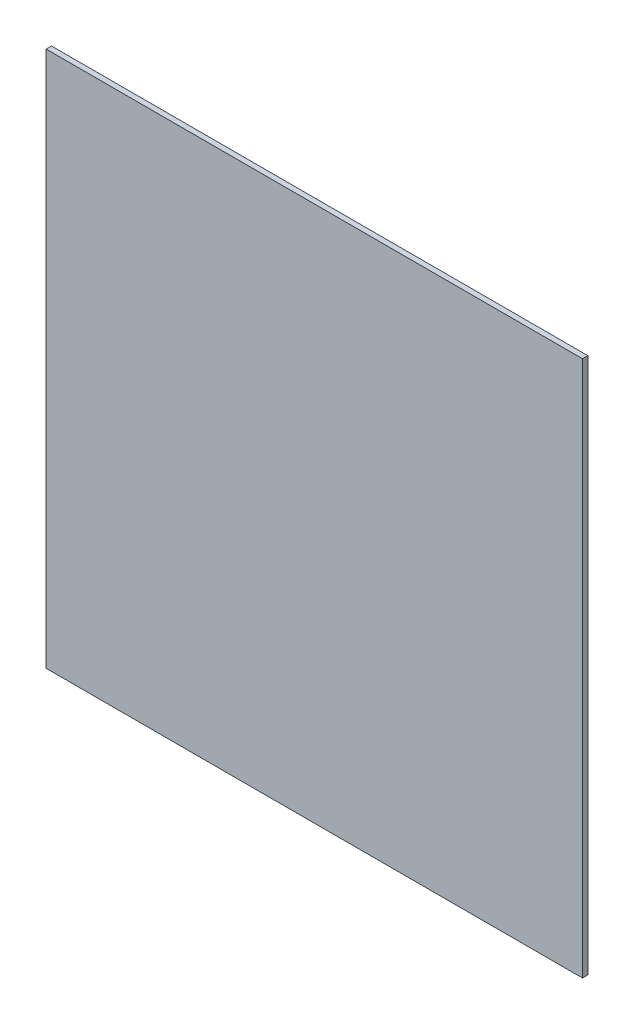
ISO-10303-21;
HEADER;
FILE_DESCRIPTION(('STEP AP214'),'2;1');
FILE_NAME('part.step','',(''),(''),'','','');
FILE_SCHEMA(('AUTOMOTIVE_DESIGN { 1 0 10303 214 1 1 1 1 }'));
ENDSEC;
DATA;
#1=APPLICATION_CONTEXT('core data for automotive mechanical design processes');
#2=APPLICATION_PROTOCOL_DEFINITION('international standard','automotive_design',2000,#1);
#3=PRODUCT_CONTEXT('',#1,'mechanical');
#4=PRODUCT('Part','Part','',(#3));
#5=PRODUCT_RELATED_PRODUCT_CATEGORY('part','',(#4));
#6=PRODUCT_DEFINITION_FORMATION('','',#4);
#7=PRODUCT_DEFINITION_CONTEXT('part definition',#1,'design');
#8=PRODUCT_DEFINITION('design','',#6,#7);
#9=PRODUCT_DEFINITION_SHAPE('','',#8);
#10=(LENGTH_UNIT() NAMED_UNIT(*) SI_UNIT(.MILLI.,.METRE.));
#11=(NAMED_UNIT(*) PLANE_ANGLE_UNIT() SI_UNIT($,.RADIAN.));
#12=(NAMED_UNIT(*) SI_UNIT($,.STERADIAN.) SOLID_ANGLE_UNIT());
#13=UNCERTAINTY_MEASURE_WITH_UNIT(LENGTH_MEASURE(1.E-05),#10,'distance_accuracy_value','');
#14=(GEOMETRIC_REPRESENTATION_CONTEXT(3) GLOBAL_UNCERTAINTY_ASSIGNED_CONTEXT((#13)) GLOBAL_UNIT_ASSIGNED_CONTEXT((#10,
#11,#12)) REPRESENTATION_CONTEXT('',''));
#15=CARTESIAN_POINT('',(0.,0.,0.));
#16=DIRECTION('',(0.,0.,1.));
#17=DIRECTION('',(1.,0.,0.));
#18=AXIS2_PLACEMENT_3D('',#15,#16,#17);
#19=CARTESIAN_POINT('',(-70.0241735800424,98.3437708565072,3.));
#20=DIRECTION('',(1.,0.,0.));
#21=DIRECTION('',(0.,1.,0.));
#22=AXIS2_PLACEMENT_3D('',#19,#20,#21);
#23=PLANE('',#22);
#24=DIRECTION('',(0.,-1.,0.));
#25=VECTOR('',#24,1.);
#26=CARTESIAN_POINT('',(-70.0241735800424,98.3437708565072,0.));
#27=LINE('',#26,#25);
#28=CARTESIAN_POINT('',(-70.0241735800424,98.3437708565072,0.));
#29=VERTEX_POINT('',#28);
#30=CARTESIAN_POINT('',(-70.0241735800424,-201.656229143493,0.));
#31=VERTEX_POINT('',#30);
#32=EDGE_CURVE('E94',#29,#31,#27,.T.);
#33=ORIENTED_EDGE('',*,*,#32,.T.);
#34=DIRECTION('',(0.,0.,-1.));
#35=VECTOR('',#34,1.);
#36=CARTESIAN_POINT('',(-70.0241735800424,-201.656229143493,3.));
#37=LINE('',#36,#35);
#38=CARTESIAN_POINT('',(-70.0241735800424,-201.656229143493,3.));
#39=VERTEX_POINT('',#38);
#40=EDGE_CURVE('E11',#39,#31,#37,.T.);
#41=ORIENTED_EDGE('',*,*,#40,.F.);
#42=DIRECTION('',(0.,-1.,0.));
#43=VECTOR('',#42,1.);
#44=CARTESIAN_POINT('',(-70.0241735800424,98.3437708565072,3.));
#45=LINE('',#44,#43);
#46=CARTESIAN_POINT('',(-70.0241735800424,98.3437708565072,3.));
#47=VERTEX_POINT('',#46);
#48=EDGE_CURVE('E82',#47,#39,#45,.T.);
#49=ORIENTED_EDGE('',*,*,#48,.F.);
#50=DIRECTION('',(0.,0.,-1.));
#51=VECTOR('',#50,1.);
#52=CARTESIAN_POINT('',(-70.0241735800424,98.3437708565072,3.));
#53=LINE('',#52,#51);
#54=EDGE_CURVE('E90',#47,#29,#53,.T.);
#55=ORIENTED_EDGE('',*,*,#54,.T.);
#56=EDGE_LOOP('',(#33,#41,#49,#55));
#57=FACE_BOUND('',#56,.T.);
#58=ADVANCED_FACE('F31',(#57),#23,.F.);
#59=CARTESIAN_POINT('',(-70.0241735800424,-201.656229143493,3.));
#60=DIRECTION('',(0.,1.,0.));
#61=DIRECTION('',(-1.,0.,0.));
#62=AXIS2_PLACEMENT_3D('',#59,#60,#61);
#63=PLANE('',#62);
#64=DIRECTION('',(1.,0.,0.));
#65=VECTOR('',#64,1.);
#66=CARTESIAN_POINT('',(-70.0241735800424,-201.656229143493,0.));
#67=LINE('',#66,#65);
#68=CARTESIAN_POINT('',(229.975826419958,-201.656229143493,0.));
#69=VERTEX_POINT('',#68);
#70=EDGE_CURVE('E86',#31,#69,#67,.T.);
#71=ORIENTED_EDGE('',*,*,#70,.T.);
#72=DIRECTION('',(0.,0.,-1.));
#73=VECTOR('',#72,1.);
#74=CARTESIAN_POINT('',(229.975826419958,-201.656229143493,3.));
#75=LINE('',#74,#73);
#76=CARTESIAN_POINT('',(229.975826419958,-201.656229143493,3.));
#77=VERTEX_POINT('',#76);
#78=EDGE_CURVE('E39',#77,#69,#75,.T.);
#79=ORIENTED_EDGE('',*,*,#78,.F.);
#80=DIRECTION('',(1.,0.,0.));
#81=VECTOR('',#80,1.);
#82=CARTESIAN_POINT('',(-70.0241735800424,-201.656229143493,3.));
#83=LINE('',#82,#81);
#84=EDGE_CURVE('E77',#39,#77,#83,.T.);
#85=ORIENTED_EDGE('',*,*,#84,.F.);
#86=ORIENTED_EDGE('',*,*,#40,.T.);
#87=EDGE_LOOP('',(#71,#79,#85,#86));
#88=FACE_BOUND('',#87,.T.);
#89=ADVANCED_FACE('F85',(#88),#63,.F.);
#90=CARTESIAN_POINT('',(229.975826419958,98.3437708565072,3.));
#91=DIRECTION('',(-1.,0.,0.));
#92=DIRECTION('',(0.,-1.,0.));
#93=AXIS2_PLACEMENT_3D('',#90,#91,#92);
#94=PLANE('',#93);
#95=DIRECTION('',(0.,1.,0.));
#96=VECTOR('',#95,1.);
#97=CARTESIAN_POINT('',(229.975826419958,98.3437708565072,0.));
#98=LINE('',#97,#96);
#99=CARTESIAN_POINT('',(229.975826419958,98.3437708565072,0.));
#100=VERTEX_POINT('',#99);
#101=EDGE_CURVE('E64',#69,#100,#98,.T.);
#102=ORIENTED_EDGE('',*,*,#101,.T.);
#103=DIRECTION('',(0.,0.,-1.));
#104=VECTOR('',#103,1.);
#105=CARTESIAN_POINT('',(229.975826419958,98.3437708565072,3.));
#106=LINE('',#105,#104);
#107=CARTESIAN_POINT('',(229.975826419958,98.3437708565072,3.));
#108=VERTEX_POINT('',#107);
#109=EDGE_CURVE('E87',#108,#100,#106,.T.);
#110=ORIENTED_EDGE('',*,*,#109,.F.);
#111=DIRECTION('',(0.,1.,0.));
#112=VECTOR('',#111,1.);
#113=CARTESIAN_POINT('',(229.975826419958,98.3437708565072,3.));
#114=LINE('',#113,#112);
#115=EDGE_CURVE('E80',#77,#108,#114,.T.);
#116=ORIENTED_EDGE('',*,*,#115,.F.);
#117=ORIENTED_EDGE('',*,*,#78,.T.);
#118=EDGE_LOOP('',(#102,#110,#116,#117));
#119=FACE_BOUND('',#118,.T.);
#120=ADVANCED_FACE('F88',(#119),#94,.F.);
#121=CARTESIAN_POINT('',(-70.0241735800424,98.3437708565072,3.));
#122=DIRECTION('',(0.,-1.,0.));
#123=DIRECTION('',(0.,0.,-1.));
#124=AXIS2_PLACEMENT_3D('',#121,#122,#123);
#125=PLANE('',#124);
#126=DIRECTION('',(-1.,0.,0.));
#127=VECTOR('',#126,1.);
#128=CARTESIAN_POINT('',(-70.0241735800424,98.3437708565072,0.));
#129=LINE('',#128,#127);
#130=EDGE_CURVE('E70',#100,#29,#129,.T.);
#131=ORIENTED_EDGE('',*,*,#130,.T.);
#132=ORIENTED_EDGE('',*,*,#54,.F.);
#133=DIRECTION('',(-1.,0.,0.));
#134=VECTOR('',#133,1.);
#135=CARTESIAN_POINT('',(-70.0241735800424,98.3437708565072,3.));
#136=LINE('',#135,#134);
#137=EDGE_CURVE('E47',#108,#47,#136,.T.);
#138=ORIENTED_EDGE('',*,*,#137,.F.);
#139=ORIENTED_EDGE('',*,*,#109,.T.);
#140=EDGE_LOOP('',(#131,#132,#138,#139));
#141=FACE_BOUND('',#140,.T.);
#142=ADVANCED_FACE('F101',(#141),#125,.F.);
#143=CARTESIAN_POINT('',(-70.0241735800424,-201.656229143493,3.));
#144=DIRECTION('',(0.,0.,1.));
#145=DIRECTION('',(1.,0.,0.));
#146=AXIS2_PLACEMENT_3D('',#143,#144,#145);
#147=PLANE('',#146);
#148=ORIENTED_EDGE('',*,*,#48,.T.);
#149=ORIENTED_EDGE('',*,*,#84,.T.);
#150=ORIENTED_EDGE('',*,*,#115,.T.);
#151=ORIENTED_EDGE('',*,*,#137,.T.);
#152=EDGE_LOOP('',(#148,#149,#150,#151));
#153=FACE_BOUND('',#152,.T.);
#154=ADVANCED_FACE('F78',(#153),#147,.T.);
#155=CARTESIAN_POINT('',(-70.0241735800424,-201.656229143493,0.));
#156=DIRECTION('',(0.,0.,1.));
#157=DIRECTION('',(1.,0.,0.));
#158=AXIS2_PLACEMENT_3D('',#155,#156,#157);
#159=PLANE('',#158);
#160=ORIENTED_EDGE('',*,*,#32,.F.);
#161=ORIENTED_EDGE('',*,*,#130,.F.);
#162=ORIENTED_EDGE('',*,*,#101,.F.);
#163=ORIENTED_EDGE('',*,*,#70,.F.);
#164=EDGE_LOOP('',(#160,#161,#162,#163));
#165=FACE_BOUND('',#164,.T.);
#166=ADVANCED_FACE('F104',(#165),#159,.F.);
#167=CLOSED_SHELL('',(#58,#89,#120,#142,#154,#166));
#168=MANIFOLD_SOLID_BREP('B2',#167);
#169=ADVANCED_BREP_SHAPE_REPRESENTATION('',(#18,#168),#14);
#170=SHAPE_DEFINITION_REPRESENTATION(#9,#169);
ENDSEC;
END-ISO-10303-21;
